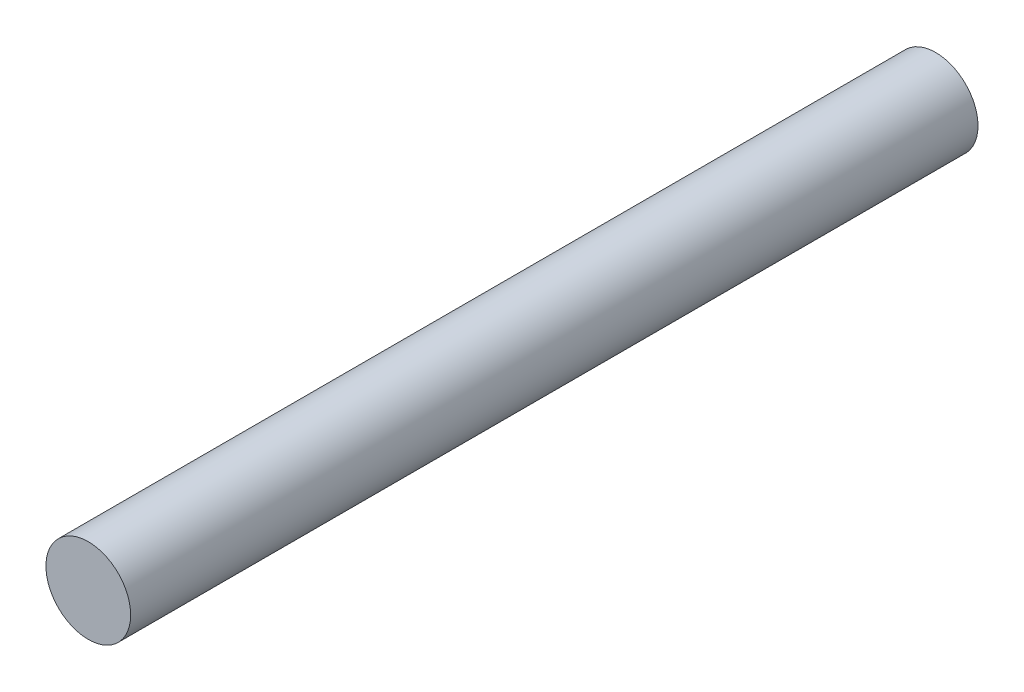
ISO-10303-21;
HEADER;
FILE_DESCRIPTION(('STEP AP214'),'2;1');
FILE_NAME('part.step','',(''),(''),'','','');
FILE_SCHEMA(('AUTOMOTIVE_DESIGN { 1 0 10303 214 1 1 1 1 }'));
ENDSEC;
DATA;
#1=APPLICATION_CONTEXT('core data for automotive mechanical design processes');
#2=APPLICATION_PROTOCOL_DEFINITION('international standard','automotive_design',2000,#1);
#3=PRODUCT_CONTEXT('',#1,'mechanical');
#4=PRODUCT('Part','Part','',(#3));
#5=PRODUCT_RELATED_PRODUCT_CATEGORY('part','',(#4));
#6=PRODUCT_DEFINITION_FORMATION('','',#4);
#7=PRODUCT_DEFINITION_CONTEXT('part definition',#1,'design');
#8=PRODUCT_DEFINITION('design','',#6,#7);
#9=PRODUCT_DEFINITION_SHAPE('','',#8);
#10=(LENGTH_UNIT() NAMED_UNIT(*) SI_UNIT(.MILLI.,.METRE.));
#11=(NAMED_UNIT(*) PLANE_ANGLE_UNIT() SI_UNIT($,.RADIAN.));
#12=(NAMED_UNIT(*) SI_UNIT($,.STERADIAN.) SOLID_ANGLE_UNIT());
#13=UNCERTAINTY_MEASURE_WITH_UNIT(LENGTH_MEASURE(1.E-05),#10,'distance_accuracy_value','');
#14=(GEOMETRIC_REPRESENTATION_CONTEXT(3) GLOBAL_UNCERTAINTY_ASSIGNED_CONTEXT((#13)) GLOBAL_UNIT_ASSIGNED_CONTEXT((#10,
#11,#12)) REPRESENTATION_CONTEXT('',''));
#15=CARTESIAN_POINT('',(0.,0.,0.));
#16=DIRECTION('',(0.,0.,1.));
#17=DIRECTION('',(1.,0.,0.));
#18=AXIS2_PLACEMENT_3D('',#15,#16,#17);
#19=CARTESIAN_POINT('',(0.,0.,3.));
#20=DIRECTION('',(0.,0.,-1.));
#21=DIRECTION('',(-1.,0.,0.));
#22=AXIS2_PLACEMENT_3D('',#19,#20,#21);
#23=CYLINDRICAL_SURFACE('',#22,0.150000000000001);
#24=CARTESIAN_POINT('',(0.,0.,3.));
#25=DIRECTION('',(0.,0.,1.));
#26=DIRECTION('',(1.,0.,0.));
#27=AXIS2_PLACEMENT_3D('',#24,#25,#26);
#28=CIRCLE('',#27,0.150000000000001);
#29=CARTESIAN_POINT('',(0.150000000000001,0.,3.));
#30=VERTEX_POINT('',#29);
#31=EDGE_CURVE('E10',#30,#30,#28,.T.);
#32=ORIENTED_EDGE('',*,*,#31,.F.);
#33=EDGE_LOOP('',(#32));
#34=FACE_BOUND('',#33,.T.);
#35=CARTESIAN_POINT('',(0.,0.,0.));
#36=DIRECTION('',(0.,0.,1.));
#37=DIRECTION('',(1.,0.,0.));
#38=AXIS2_PLACEMENT_3D('',#35,#36,#37);
#39=CIRCLE('',#38,0.150000000000001);
#40=CARTESIAN_POINT('',(0.150000000000001,0.,0.));
#41=VERTEX_POINT('',#40);
#42=EDGE_CURVE('E38',#41,#41,#39,.T.);
#43=ORIENTED_EDGE('',*,*,#42,.T.);
#44=EDGE_LOOP('',(#43));
#45=FACE_BOUND('',#44,.T.);
#46=ADVANCED_FACE('F35',(#34,#45),#23,.T.);
#47=CARTESIAN_POINT('',(0.,0.,3.));
#48=DIRECTION('',(0.,0.,1.));
#49=DIRECTION('',(1.,0.,0.));
#50=AXIS2_PLACEMENT_3D('',#47,#48,#49);
#51=PLANE('',#50);
#52=ORIENTED_EDGE('',*,*,#31,.T.);
#53=EDGE_LOOP('',(#52));
#54=FACE_BOUND('',#53,.T.);
#55=ADVANCED_FACE('F50',(#54),#51,.T.);
#56=CARTESIAN_POINT('',(0.,0.,0.));
#57=DIRECTION('',(0.,0.,1.));
#58=DIRECTION('',(1.,0.,0.));
#59=AXIS2_PLACEMENT_3D('',#56,#57,#58);
#60=PLANE('',#59);
#61=ORIENTED_EDGE('',*,*,#42,.F.);
#62=EDGE_LOOP('',(#61));
#63=FACE_BOUND('',#62,.T.);
#64=ADVANCED_FACE('F48',(#63),#60,.F.);
#65=CLOSED_SHELL('',(#46,#55,#64));
#66=MANIFOLD_SOLID_BREP('B2',#65);
#67=ADVANCED_BREP_SHAPE_REPRESENTATION('',(#18,#66),#14);
#68=SHAPE_DEFINITION_REPRESENTATION(#9,#67);
ENDSEC;
END-ISO-10303-21;
